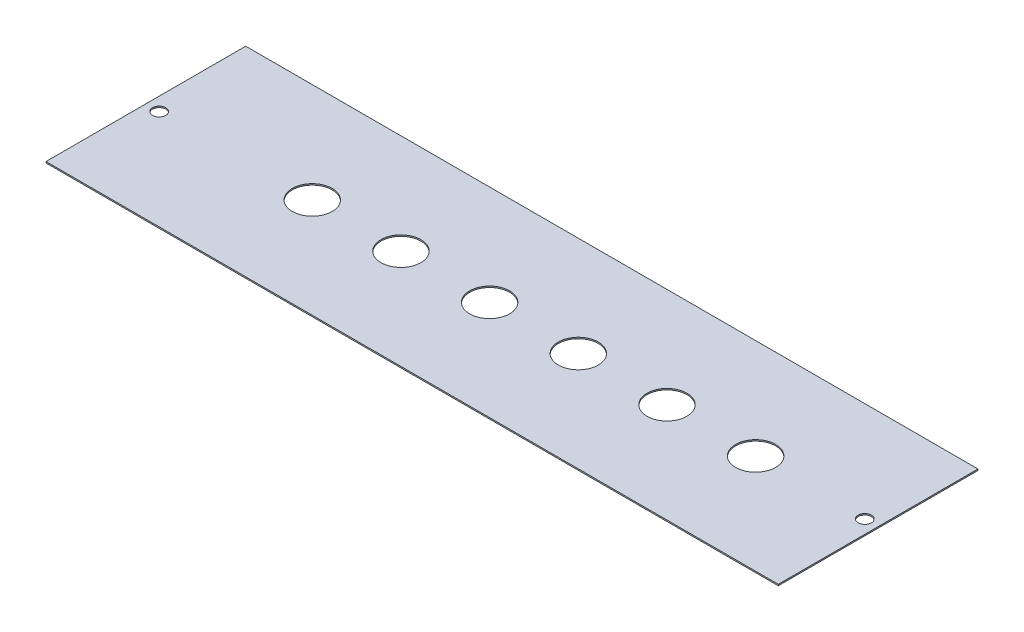
ISO-10303-21;
HEADER;
FILE_DESCRIPTION(('STEP AP214'),'2;1');
FILE_NAME('part.step','',(''),(''),'','','');
FILE_SCHEMA(('AUTOMOTIVE_DESIGN { 1 0 10303 214 1 1 1 1 }'));
ENDSEC;
DATA;
#1=APPLICATION_CONTEXT('core data for automotive mechanical design processes');
#2=APPLICATION_PROTOCOL_DEFINITION('international standard','automotive_design',2000,#1);
#3=PRODUCT_CONTEXT('',#1,'mechanical');
#4=PRODUCT('Part','Part','',(#3));
#5=PRODUCT_RELATED_PRODUCT_CATEGORY('part','',(#4));
#6=PRODUCT_DEFINITION_FORMATION('','',#4);
#7=PRODUCT_DEFINITION_CONTEXT('part definition',#1,'design');
#8=PRODUCT_DEFINITION('design','',#6,#7);
#9=PRODUCT_DEFINITION_SHAPE('','',#8);
#10=(LENGTH_UNIT() NAMED_UNIT(*) SI_UNIT(.MILLI.,.METRE.));
#11=(NAMED_UNIT(*) PLANE_ANGLE_UNIT() SI_UNIT($,.RADIAN.));
#12=(NAMED_UNIT(*) SI_UNIT($,.STERADIAN.) SOLID_ANGLE_UNIT());
#13=UNCERTAINTY_MEASURE_WITH_UNIT(LENGTH_MEASURE(1.E-05),#10,'distance_accuracy_value','');
#14=(GEOMETRIC_REPRESENTATION_CONTEXT(3) GLOBAL_UNCERTAINTY_ASSIGNED_CONTEXT((#13)) GLOBAL_UNIT_ASSIGNED_CONTEXT((#10,
#11,#12)) REPRESENTATION_CONTEXT('',''));
#15=CARTESIAN_POINT('',(0.,0.,0.));
#16=DIRECTION('',(0.,0.,1.));
#17=DIRECTION('',(1.,0.,0.));
#18=AXIS2_PLACEMENT_3D('',#15,#16,#17);
#19=CARTESIAN_POINT('',(-275.,-1.,75.));
#20=DIRECTION('',(-1.,0.,0.));
#21=DIRECTION('',(0.,0.,1.));
#22=AXIS2_PLACEMENT_3D('',#19,#20,#21);
#23=PLANE('',#22);
#24=DIRECTION('',(0.,0.,1.));
#25=VECTOR('',#24,1.);
#26=CARTESIAN_POINT('',(-275.,0.,75.));
#27=LINE('',#26,#25);
#28=CARTESIAN_POINT('',(-275.,0.,-75.));
#29=VERTEX_POINT('',#28);
#30=CARTESIAN_POINT('',(-275.,0.,75.));
#31=VERTEX_POINT('',#30);
#32=EDGE_CURVE('E104',#29,#31,#27,.T.);
#33=ORIENTED_EDGE('',*,*,#32,.F.);
#34=DIRECTION('',(0.,1.,0.));
#35=VECTOR('',#34,1.);
#36=CARTESIAN_POINT('',(-275.,-1.,-75.));
#37=LINE('',#36,#35);
#38=CARTESIAN_POINT('',(-275.,-1.,-75.));
#39=VERTEX_POINT('',#38);
#40=EDGE_CURVE('E51',#39,#29,#37,.T.);
#41=ORIENTED_EDGE('',*,*,#40,.F.);
#42=DIRECTION('',(0.,0.,1.));
#43=VECTOR('',#42,1.);
#44=CARTESIAN_POINT('',(-275.,-1.,75.));
#45=LINE('',#44,#43);
#46=CARTESIAN_POINT('',(-275.,-1.,75.));
#47=VERTEX_POINT('',#46);
#48=EDGE_CURVE('E97',#39,#47,#45,.T.);
#49=ORIENTED_EDGE('',*,*,#48,.T.);
#50=DIRECTION('',(0.,1.,0.));
#51=VECTOR('',#50,1.);
#52=CARTESIAN_POINT('',(-275.,-1.,75.));
#53=LINE('',#52,#51);
#54=EDGE_CURVE('E79',#47,#31,#53,.T.);
#55=ORIENTED_EDGE('',*,*,#54,.T.);
#56=EDGE_LOOP('',(#33,#41,#49,#55));
#57=FACE_BOUND('',#56,.T.);
#58=ADVANCED_FACE('F34',(#57),#23,.T.);
#59=CARTESIAN_POINT('',(275.,-1.,-75.));
#60=DIRECTION('',(0.,0.,-1.));
#61=DIRECTION('',(-1.,0.,0.));
#62=AXIS2_PLACEMENT_3D('',#59,#60,#61);
#63=PLANE('',#62);
#64=DIRECTION('',(-1.,0.,0.));
#65=VECTOR('',#64,1.);
#66=CARTESIAN_POINT('',(275.,0.,-75.));
#67=LINE('',#66,#65);
#68=CARTESIAN_POINT('',(275.,0.,-75.));
#69=VERTEX_POINT('',#68);
#70=EDGE_CURVE('E99',#69,#29,#67,.T.);
#71=ORIENTED_EDGE('',*,*,#70,.F.);
#72=DIRECTION('',(0.,1.,0.));
#73=VECTOR('',#72,1.);
#74=CARTESIAN_POINT('',(275.,-1.,-75.));
#75=LINE('',#74,#73);
#76=CARTESIAN_POINT('',(275.,-1.,-75.));
#77=VERTEX_POINT('',#76);
#78=EDGE_CURVE('E68',#77,#69,#75,.T.);
#79=ORIENTED_EDGE('',*,*,#78,.F.);
#80=DIRECTION('',(-1.,0.,0.));
#81=VECTOR('',#80,1.);
#82=CARTESIAN_POINT('',(275.,-1.,-75.));
#83=LINE('',#82,#81);
#84=EDGE_CURVE('E94',#77,#39,#83,.T.);
#85=ORIENTED_EDGE('',*,*,#84,.T.);
#86=ORIENTED_EDGE('',*,*,#40,.T.);
#87=EDGE_LOOP('',(#71,#79,#85,#86));
#88=FACE_BOUND('',#87,.T.);
#89=ADVANCED_FACE('F158',(#88),#63,.T.);
#90=CARTESIAN_POINT('',(275.,-1.,75.));
#91=DIRECTION('',(1.,0.,0.));
#92=DIRECTION('',(0.,0.,-1.));
#93=AXIS2_PLACEMENT_3D('',#90,#91,#92);
#94=PLANE('',#93);
#95=DIRECTION('',(0.,0.,-1.));
#96=VECTOR('',#95,1.);
#97=CARTESIAN_POINT('',(275.,0.,75.));
#98=LINE('',#97,#96);
#99=CARTESIAN_POINT('',(275.,0.,75.));
#100=VERTEX_POINT('',#99);
#101=EDGE_CURVE('E87',#100,#69,#98,.T.);
#102=ORIENTED_EDGE('',*,*,#101,.F.);
#103=DIRECTION('',(0.,1.,0.));
#104=VECTOR('',#103,1.);
#105=CARTESIAN_POINT('',(275.,-1.,75.));
#106=LINE('',#105,#104);
#107=CARTESIAN_POINT('',(275.,-1.,75.));
#108=VERTEX_POINT('',#107);
#109=EDGE_CURVE('E82',#108,#100,#106,.T.);
#110=ORIENTED_EDGE('',*,*,#109,.F.);
#111=DIRECTION('',(0.,0.,-1.));
#112=VECTOR('',#111,1.);
#113=CARTESIAN_POINT('',(275.,-1.,75.));
#114=LINE('',#113,#112);
#115=EDGE_CURVE('E85',#108,#77,#114,.T.);
#116=ORIENTED_EDGE('',*,*,#115,.T.);
#117=ORIENTED_EDGE('',*,*,#78,.T.);
#118=EDGE_LOOP('',(#102,#110,#116,#117));
#119=FACE_BOUND('',#118,.T.);
#120=ADVANCED_FACE('F84',(#119),#94,.T.);
#121=CARTESIAN_POINT('',(275.,-1.,75.));
#122=DIRECTION('',(0.,0.,1.));
#123=DIRECTION('',(1.,0.,0.));
#124=AXIS2_PLACEMENT_3D('',#121,#122,#123);
#125=PLANE('',#124);
#126=DIRECTION('',(1.,0.,0.));
#127=VECTOR('',#126,1.);
#128=CARTESIAN_POINT('',(275.,0.,75.));
#129=LINE('',#128,#127);
#130=EDGE_CURVE('E107',#31,#100,#129,.T.);
#131=ORIENTED_EDGE('',*,*,#130,.F.);
#132=ORIENTED_EDGE('',*,*,#54,.F.);
#133=DIRECTION('',(1.,0.,0.));
#134=VECTOR('',#133,1.);
#135=CARTESIAN_POINT('',(275.,-1.,75.));
#136=LINE('',#135,#134);
#137=EDGE_CURVE('E93',#47,#108,#136,.T.);
#138=ORIENTED_EDGE('',*,*,#137,.T.);
#139=ORIENTED_EDGE('',*,*,#109,.T.);
#140=EDGE_LOOP('',(#131,#132,#138,#139));
#141=FACE_BOUND('',#140,.T.);
#142=ADVANCED_FACE('F96',(#141),#125,.T.);
#143=CARTESIAN_POINT('',(-275.,-1.,-75.));
#144=DIRECTION('',(0.,1.,0.));
#145=DIRECTION('',(0.,0.,1.));
#146=AXIS2_PLACEMENT_3D('',#143,#144,#145);
#147=PLANE('',#146);
#148=CARTESIAN_POINT('',(-83.4,-1.,0.));
#149=DIRECTION('',(0.,-1.,0.));
#150=DIRECTION('',(0.,0.,-1.));
#151=AXIS2_PLACEMENT_3D('',#148,#149,#150);
#152=CIRCLE('',#151,15.);
#153=CARTESIAN_POINT('',(-83.4,-1.,-15.));
#154=VERTEX_POINT('',#153);
#155=EDGE_CURVE('E322',#154,#154,#152,.T.);
#156=ORIENTED_EDGE('',*,*,#155,.F.);
#157=EDGE_LOOP('',(#156));
#158=FACE_BOUND('',#157,.T.);
#159=CARTESIAN_POINT('',(-150.,-1.,0.));
#160=DIRECTION('',(0.,-1.,0.));
#161=DIRECTION('',(0.,0.,-1.));
#162=AXIS2_PLACEMENT_3D('',#159,#160,#161);
#163=CIRCLE('',#162,15.);
#164=CARTESIAN_POINT('',(-150.,-1.,-15.));
#165=VERTEX_POINT('',#164);
#166=EDGE_CURVE('E319',#165,#165,#163,.T.);
#167=ORIENTED_EDGE('',*,*,#166,.F.);
#168=EDGE_LOOP('',(#167));
#169=FACE_BOUND('',#168,.T.);
#170=CARTESIAN_POINT('',(265.,-1.,0.));
#171=DIRECTION('',(0.,1.,0.));
#172=DIRECTION('',(0.,0.,1.));
#173=AXIS2_PLACEMENT_3D('',#170,#171,#172);
#174=CIRCLE('',#173,4.99999999999999);
#175=CARTESIAN_POINT('',(265.,-1.,4.99999999999999));
#176=VERTEX_POINT('',#175);
#177=EDGE_CURVE('E310',#176,#176,#174,.T.);
#178=ORIENTED_EDGE('',*,*,#177,.T.);
#179=EDGE_LOOP('',(#178));
#180=FACE_BOUND('',#179,.T.);
#181=CARTESIAN_POINT('',(-265.,-1.,0.));
#182=DIRECTION('',(0.,1.,0.));
#183=DIRECTION('',(0.,0.,1.));
#184=AXIS2_PLACEMENT_3D('',#181,#182,#183);
#185=CIRCLE('',#184,4.99999999999999);
#186=CARTESIAN_POINT('',(-265.,-1.,4.99999999999999));
#187=VERTEX_POINT('',#186);
#188=EDGE_CURVE('E108',#187,#187,#185,.T.);
#189=ORIENTED_EDGE('',*,*,#188,.T.);
#190=EDGE_LOOP('',(#189));
#191=FACE_BOUND('',#190,.T.);
#192=ORIENTED_EDGE('',*,*,#48,.F.);
#193=ORIENTED_EDGE('',*,*,#84,.F.);
#194=ORIENTED_EDGE('',*,*,#115,.F.);
#195=ORIENTED_EDGE('',*,*,#137,.F.);
#196=EDGE_LOOP('',(#192,#193,#194,#195));
#197=FACE_BOUND('',#196,.T.);
#198=CARTESIAN_POINT('',(-16.8,-1.,0.));
#199=DIRECTION('',(0.,-1.,0.));
#200=DIRECTION('',(0.,0.,-1.));
#201=AXIS2_PLACEMENT_3D('',#198,#199,#200);
#202=CIRCLE('',#201,15.);
#203=CARTESIAN_POINT('',(-16.8,-1.,-15.));
#204=VERTEX_POINT('',#203);
#205=EDGE_CURVE('E119',#204,#204,#202,.T.);
#206=ORIENTED_EDGE('',*,*,#205,.F.);
#207=EDGE_LOOP('',(#206));
#208=FACE_BOUND('',#207,.T.);
#209=CARTESIAN_POINT('',(49.8,-1.,0.));
#210=DIRECTION('',(0.,-1.,0.));
#211=DIRECTION('',(0.,0.,-1.));
#212=AXIS2_PLACEMENT_3D('',#209,#210,#211);
#213=CIRCLE('',#212,15.);
#214=CARTESIAN_POINT('',(49.8,-1.,-15.0000000000001));
#215=VERTEX_POINT('',#214);
#216=EDGE_CURVE('E125',#215,#215,#213,.T.);
#217=ORIENTED_EDGE('',*,*,#216,.F.);
#218=EDGE_LOOP('',(#217));
#219=FACE_BOUND('',#218,.T.);
#220=CARTESIAN_POINT('',(116.4,-1.,0.));
#221=DIRECTION('',(0.,-1.,0.));
#222=DIRECTION('',(0.,0.,-1.));
#223=AXIS2_PLACEMENT_3D('',#220,#221,#222);
#224=CIRCLE('',#223,15.);
#225=CARTESIAN_POINT('',(116.4,-1.,-15.0000000000001));
#226=VERTEX_POINT('',#225);
#227=EDGE_CURVE('E131',#226,#226,#224,.T.);
#228=ORIENTED_EDGE('',*,*,#227,.F.);
#229=EDGE_LOOP('',(#228));
#230=FACE_BOUND('',#229,.T.);
#231=CARTESIAN_POINT('',(183.,-1.,0.));
#232=DIRECTION('',(0.,-1.,0.));
#233=DIRECTION('',(0.,0.,-1.));
#234=AXIS2_PLACEMENT_3D('',#231,#232,#233);
#235=CIRCLE('',#234,15.);
#236=CARTESIAN_POINT('',(183.,-1.,-15.0000000000001));
#237=VERTEX_POINT('',#236);
#238=EDGE_CURVE('E11',#237,#237,#235,.T.);
#239=ORIENTED_EDGE('',*,*,#238,.F.);
#240=EDGE_LOOP('',(#239));
#241=FACE_BOUND('',#240,.T.);
#242=ADVANCED_FACE('F91',(#158,#169,#180,#191,#197,#208,#219,#230,#241),#147,.F.);
#243=CARTESIAN_POINT('',(-275.,0.,-75.));
#244=DIRECTION('',(0.,1.,0.));
#245=DIRECTION('',(0.,0.,1.));
#246=AXIS2_PLACEMENT_3D('',#243,#244,#245);
#247=PLANE('',#246);
#248=CARTESIAN_POINT('',(-83.4,0.,0.));
#249=DIRECTION('',(0.,-1.,0.));
#250=DIRECTION('',(0.,0.,-1.));
#251=AXIS2_PLACEMENT_3D('',#248,#249,#250);
#252=CIRCLE('',#251,15.);
#253=CARTESIAN_POINT('',(-83.4,0.,-15.));
#254=VERTEX_POINT('',#253);
#255=EDGE_CURVE('E327',#254,#254,#252,.T.);
#256=ORIENTED_EDGE('',*,*,#255,.T.);
#257=EDGE_LOOP('',(#256));
#258=FACE_BOUND('',#257,.T.);
#259=CARTESIAN_POINT('',(-150.,0.,0.));
#260=DIRECTION('',(0.,-1.,0.));
#261=DIRECTION('',(0.,0.,-1.));
#262=AXIS2_PLACEMENT_3D('',#259,#260,#261);
#263=CIRCLE('',#262,15.);
#264=CARTESIAN_POINT('',(-150.,0.,-15.));
#265=VERTEX_POINT('',#264);
#266=EDGE_CURVE('E317',#265,#265,#263,.T.);
#267=ORIENTED_EDGE('',*,*,#266,.T.);
#268=EDGE_LOOP('',(#267));
#269=FACE_BOUND('',#268,.T.);
#270=CARTESIAN_POINT('',(265.,0.,0.));
#271=DIRECTION('',(0.,1.,0.));
#272=DIRECTION('',(0.,0.,1.));
#273=AXIS2_PLACEMENT_3D('',#270,#271,#272);
#274=CIRCLE('',#273,4.99999999999999);
#275=CARTESIAN_POINT('',(265.,0.,4.99999999999999));
#276=VERTEX_POINT('',#275);
#277=EDGE_CURVE('E313',#276,#276,#274,.T.);
#278=ORIENTED_EDGE('',*,*,#277,.F.);
#279=EDGE_LOOP('',(#278));
#280=FACE_BOUND('',#279,.T.);
#281=CARTESIAN_POINT('',(-265.,0.,0.));
#282=DIRECTION('',(0.,1.,0.));
#283=DIRECTION('',(0.,0.,1.));
#284=AXIS2_PLACEMENT_3D('',#281,#282,#283);
#285=CIRCLE('',#284,4.99999999999999);
#286=CARTESIAN_POINT('',(-265.,0.,4.99999999999999));
#287=VERTEX_POINT('',#286);
#288=EDGE_CURVE('E308',#287,#287,#285,.T.);
#289=ORIENTED_EDGE('',*,*,#288,.F.);
#290=EDGE_LOOP('',(#289));
#291=FACE_BOUND('',#290,.T.);
#292=ORIENTED_EDGE('',*,*,#32,.T.);
#293=ORIENTED_EDGE('',*,*,#130,.T.);
#294=ORIENTED_EDGE('',*,*,#101,.T.);
#295=ORIENTED_EDGE('',*,*,#70,.T.);
#296=EDGE_LOOP('',(#292,#293,#294,#295));
#297=FACE_BOUND('',#296,.T.);
#298=CARTESIAN_POINT('',(-16.8,0.,0.));
#299=DIRECTION('',(0.,-1.,0.));
#300=DIRECTION('',(0.,0.,-1.));
#301=AXIS2_PLACEMENT_3D('',#298,#299,#300);
#302=CIRCLE('',#301,15.);
#303=CARTESIAN_POINT('',(-16.8,0.,-15.));
#304=VERTEX_POINT('',#303);
#305=EDGE_CURVE('E114',#304,#304,#302,.T.);
#306=ORIENTED_EDGE('',*,*,#305,.T.);
#307=EDGE_LOOP('',(#306));
#308=FACE_BOUND('',#307,.T.);
#309=CARTESIAN_POINT('',(49.8,0.,0.));
#310=DIRECTION('',(0.,-1.,0.));
#311=DIRECTION('',(0.,0.,-1.));
#312=AXIS2_PLACEMENT_3D('',#309,#310,#311);
#313=CIRCLE('',#312,15.);
#314=CARTESIAN_POINT('',(49.8,0.,-15.0000000000001));
#315=VERTEX_POINT('',#314);
#316=EDGE_CURVE('E122',#315,#315,#313,.T.);
#317=ORIENTED_EDGE('',*,*,#316,.T.);
#318=EDGE_LOOP('',(#317));
#319=FACE_BOUND('',#318,.T.);
#320=CARTESIAN_POINT('',(116.4,0.,0.));
#321=DIRECTION('',(0.,-1.,0.));
#322=DIRECTION('',(0.,0.,-1.));
#323=AXIS2_PLACEMENT_3D('',#320,#321,#322);
#324=CIRCLE('',#323,15.);
#325=CARTESIAN_POINT('',(116.4,0.,-15.0000000000001));
#326=VERTEX_POINT('',#325);
#327=EDGE_CURVE('E128',#326,#326,#324,.T.);
#328=ORIENTED_EDGE('',*,*,#327,.T.);
#329=EDGE_LOOP('',(#328));
#330=FACE_BOUND('',#329,.T.);
#331=CARTESIAN_POINT('',(183.,0.,0.));
#332=DIRECTION('',(0.,-1.,0.));
#333=DIRECTION('',(0.,0.,-1.));
#334=AXIS2_PLACEMENT_3D('',#331,#332,#333);
#335=CIRCLE('',#334,15.);
#336=CARTESIAN_POINT('',(183.,0.,-15.0000000000001));
#337=VERTEX_POINT('',#336);
#338=EDGE_CURVE('E43',#337,#337,#335,.T.);
#339=ORIENTED_EDGE('',*,*,#338,.T.);
#340=EDGE_LOOP('',(#339));
#341=FACE_BOUND('',#340,.T.);
#342=ADVANCED_FACE('F136',(#258,#269,#280,#291,#297,#308,#319,#330,#341),#247,.T.);
#343=CARTESIAN_POINT('',(-265.,-1.,0.));
#344=DIRECTION('',(0.,1.,0.));
#345=DIRECTION('',(0.,0.,1.));
#346=AXIS2_PLACEMENT_3D('',#343,#344,#345);
#347=CYLINDRICAL_SURFACE('',#346,4.99999999999999);
#348=ORIENTED_EDGE('',*,*,#188,.F.);
#349=EDGE_LOOP('',(#348));
#350=FACE_BOUND('',#349,.T.);
#351=ORIENTED_EDGE('',*,*,#288,.T.);
#352=EDGE_LOOP('',(#351));
#353=FACE_BOUND('',#352,.T.);
#354=ADVANCED_FACE('F150',(#350,#353),#347,.F.);
#355=CARTESIAN_POINT('',(265.,-1.,0.));
#356=DIRECTION('',(0.,1.,0.));
#357=DIRECTION('',(0.,0.,1.));
#358=AXIS2_PLACEMENT_3D('',#355,#356,#357);
#359=CYLINDRICAL_SURFACE('',#358,4.99999999999999);
#360=ORIENTED_EDGE('',*,*,#177,.F.);
#361=EDGE_LOOP('',(#360));
#362=FACE_BOUND('',#361,.T.);
#363=ORIENTED_EDGE('',*,*,#277,.T.);
#364=EDGE_LOOP('',(#363));
#365=FACE_BOUND('',#364,.T.);
#366=ADVANCED_FACE('F231',(#362,#365),#359,.F.);
#367=CARTESIAN_POINT('',(-150.,0.,0.));
#368=DIRECTION('',(0.,-1.,0.));
#369=DIRECTION('',(0.,0.,-1.));
#370=AXIS2_PLACEMENT_3D('',#367,#368,#369);
#371=CYLINDRICAL_SURFACE('',#370,15.);
#372=ORIENTED_EDGE('',*,*,#266,.F.);
#373=EDGE_LOOP('',(#372));
#374=FACE_BOUND('',#373,.T.);
#375=ORIENTED_EDGE('',*,*,#166,.T.);
#376=EDGE_LOOP('',(#375));
#377=FACE_BOUND('',#376,.T.);
#378=ADVANCED_FACE('F219',(#374,#377),#371,.F.);
#379=CARTESIAN_POINT('',(-83.4,0.,0.));
#380=DIRECTION('',(0.,-1.,0.));
#381=DIRECTION('',(0.,0.,-1.));
#382=AXIS2_PLACEMENT_3D('',#379,#380,#381);
#383=CYLINDRICAL_SURFACE('',#382,15.);
#384=ORIENTED_EDGE('',*,*,#255,.F.);
#385=EDGE_LOOP('',(#384));
#386=FACE_BOUND('',#385,.T.);
#387=ORIENTED_EDGE('',*,*,#155,.T.);
#388=EDGE_LOOP('',(#387));
#389=FACE_BOUND('',#388,.T.);
#390=ADVANCED_FACE('F170',(#386,#389),#383,.F.);
#391=CARTESIAN_POINT('',(-16.8,0.,0.));
#392=DIRECTION('',(0.,-1.,0.));
#393=DIRECTION('',(0.,0.,-1.));
#394=AXIS2_PLACEMENT_3D('',#391,#392,#393);
#395=CYLINDRICAL_SURFACE('',#394,15.);
#396=ORIENTED_EDGE('',*,*,#305,.F.);
#397=EDGE_LOOP('',(#396));
#398=FACE_BOUND('',#397,.T.);
#399=ORIENTED_EDGE('',*,*,#205,.T.);
#400=EDGE_LOOP('',(#399));
#401=FACE_BOUND('',#400,.T.);
#402=ADVANCED_FACE('F166',(#398,#401),#395,.F.);
#403=CARTESIAN_POINT('',(49.8,0.,0.));
#404=DIRECTION('',(0.,-1.,0.));
#405=DIRECTION('',(0.,0.,-1.));
#406=AXIS2_PLACEMENT_3D('',#403,#404,#405);
#407=CYLINDRICAL_SURFACE('',#406,15.);
#408=ORIENTED_EDGE('',*,*,#316,.F.);
#409=EDGE_LOOP('',(#408));
#410=FACE_BOUND('',#409,.T.);
#411=ORIENTED_EDGE('',*,*,#216,.T.);
#412=EDGE_LOOP('',(#411));
#413=FACE_BOUND('',#412,.T.);
#414=ADVANCED_FACE('F169',(#410,#413),#407,.F.);
#415=CARTESIAN_POINT('',(116.4,0.,0.));
#416=DIRECTION('',(0.,-1.,0.));
#417=DIRECTION('',(0.,0.,-1.));
#418=AXIS2_PLACEMENT_3D('',#415,#416,#417);
#419=CYLINDRICAL_SURFACE('',#418,15.);
#420=ORIENTED_EDGE('',*,*,#327,.F.);
#421=EDGE_LOOP('',(#420));
#422=FACE_BOUND('',#421,.T.);
#423=ORIENTED_EDGE('',*,*,#227,.T.);
#424=EDGE_LOOP('',(#423));
#425=FACE_BOUND('',#424,.T.);
#426=ADVANCED_FACE('F140',(#422,#425),#419,.F.);
#427=CARTESIAN_POINT('',(183.,0.,0.));
#428=DIRECTION('',(0.,-1.,0.));
#429=DIRECTION('',(0.,0.,-1.));
#430=AXIS2_PLACEMENT_3D('',#427,#428,#429);
#431=CYLINDRICAL_SURFACE('',#430,15.);
#432=ORIENTED_EDGE('',*,*,#338,.F.);
#433=EDGE_LOOP('',(#432));
#434=FACE_BOUND('',#433,.T.);
#435=ORIENTED_EDGE('',*,*,#238,.T.);
#436=EDGE_LOOP('',(#435));
#437=FACE_BOUND('',#436,.T.);
#438=ADVANCED_FACE('F36',(#434,#437),#431,.F.);
#439=CLOSED_SHELL('',(#58,#89,#120,#142,#242,#342,#354,#366,#378,#390,#402,#414,#426,#438));
#440=MANIFOLD_SOLID_BREP('B2',#439);
#441=ADVANCED_BREP_SHAPE_REPRESENTATION('',(#18,#440),#14);
#442=SHAPE_DEFINITION_REPRESENTATION(#9,#441);
ENDSEC;
END-ISO-10303-21;
